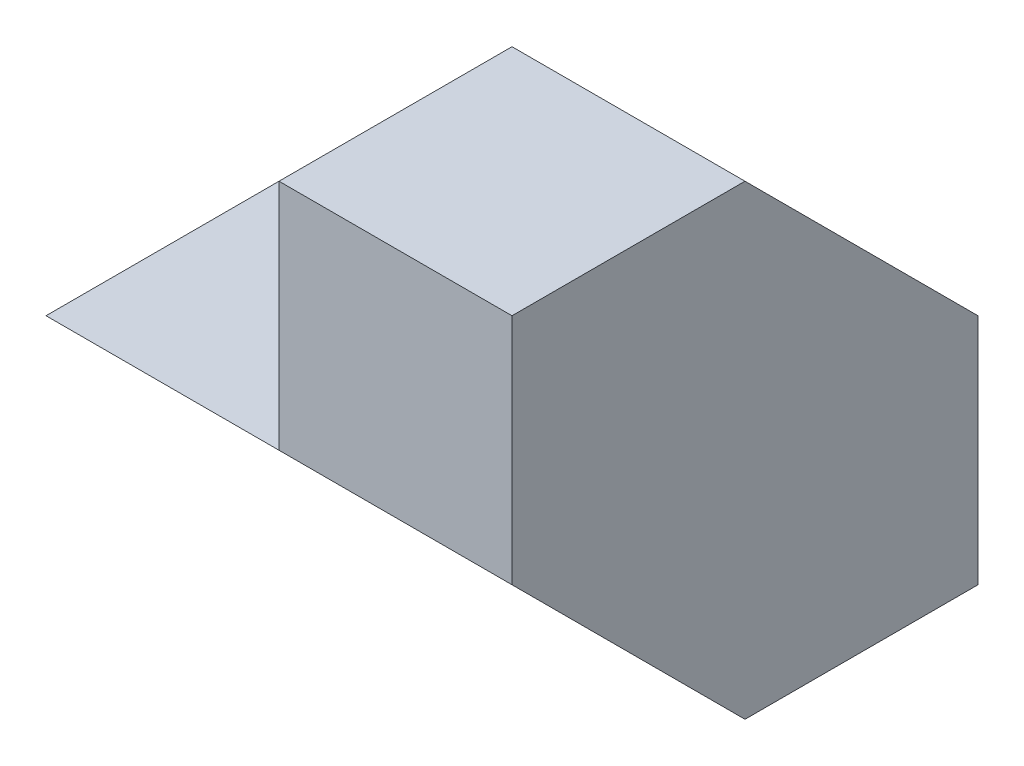
ISO-10303-21;
HEADER;
FILE_DESCRIPTION(('STEP AP214'),'2;1');
FILE_NAME('part.step','',(''),(''),'','','');
FILE_SCHEMA(('AUTOMOTIVE_DESIGN { 1 0 10303 214 1 1 1 1 }'));
ENDSEC;
DATA;
#1=APPLICATION_CONTEXT('core data for automotive mechanical design processes');
#2=APPLICATION_PROTOCOL_DEFINITION('international standard','automotive_design',2000,#1);
#3=PRODUCT_CONTEXT('',#1,'mechanical');
#4=PRODUCT('Part','Part','',(#3));
#5=PRODUCT_RELATED_PRODUCT_CATEGORY('part','',(#4));
#6=PRODUCT_DEFINITION_FORMATION('','',#4);
#7=PRODUCT_DEFINITION_CONTEXT('part definition',#1,'design');
#8=PRODUCT_DEFINITION('design','',#6,#7);
#9=PRODUCT_DEFINITION_SHAPE('','',#8);
#10=(LENGTH_UNIT() NAMED_UNIT(*) SI_UNIT(.MILLI.,.METRE.));
#11=(NAMED_UNIT(*) PLANE_ANGLE_UNIT() SI_UNIT($,.RADIAN.));
#12=(NAMED_UNIT(*) SI_UNIT($,.STERADIAN.) SOLID_ANGLE_UNIT());
#13=UNCERTAINTY_MEASURE_WITH_UNIT(LENGTH_MEASURE(1.E-05),#10,'distance_accuracy_value','');
#14=(GEOMETRIC_REPRESENTATION_CONTEXT(3) GLOBAL_UNCERTAINTY_ASSIGNED_CONTEXT((#13)) GLOBAL_UNIT_ASSIGNED_CONTEXT((#10,
#11,#12)) REPRESENTATION_CONTEXT('',''));
#15=CARTESIAN_POINT('',(0.,0.,0.));
#16=DIRECTION('',(0.,0.,1.));
#17=DIRECTION('',(1.,0.,0.));
#18=AXIS2_PLACEMENT_3D('',#15,#16,#17);
#19=CARTESIAN_POINT('',(0.,0.,40.));
#20=DIRECTION('',(1.,0.,0.));
#21=DIRECTION('',(0.,0.,-1.));
#22=AXIS2_PLACEMENT_3D('',#19,#20,#21);
#23=PLANE('',#22);
#24=DIRECTION('',(0.,0.,-1.));
#25=VECTOR('',#24,1.);
#26=CARTESIAN_POINT('',(0.,0.,40.));
#27=LINE('',#26,#25);
#28=CARTESIAN_POINT('',(0.,0.,20.));
#29=VERTEX_POINT('',#28);
#30=CARTESIAN_POINT('',(0.,0.,0.));
#31=VERTEX_POINT('',#30);
#32=EDGE_CURVE('E11',#29,#31,#27,.T.);
#33=ORIENTED_EDGE('',*,*,#32,.F.);
#34=DIRECTION('',(0.,-0.707106781186548,-0.707106781186548));
#35=VECTOR('',#34,1.);
#36=CARTESIAN_POINT('',(0.,20.,40.));
#37=LINE('',#36,#35);
#38=CARTESIAN_POINT('',(0.,20.,40.));
#39=VERTEX_POINT('',#38);
#40=EDGE_CURVE('E114',#39,#29,#37,.T.);
#41=ORIENTED_EDGE('',*,*,#40,.F.);
#42=DIRECTION('',(0.,0.,-1.));
#43=VECTOR('',#42,1.);
#44=CARTESIAN_POINT('',(0.,20.,40.));
#45=LINE('',#44,#43);
#46=CARTESIAN_POINT('',(0.,20.,0.));
#47=VERTEX_POINT('',#46);
#48=EDGE_CURVE('E160',#39,#47,#45,.T.);
#49=ORIENTED_EDGE('',*,*,#48,.T.);
#50=DIRECTION('',(0.,-1.,0.));
#51=VECTOR('',#50,1.);
#52=CARTESIAN_POINT('',(0.,0.,0.));
#53=LINE('',#52,#51);
#54=EDGE_CURVE('E150',#47,#31,#53,.T.);
#55=ORIENTED_EDGE('',*,*,#54,.T.);
#56=EDGE_LOOP('',(#33,#41,#49,#55));
#57=FACE_BOUND('',#56,.T.);
#58=ADVANCED_FACE('F33',(#57),#23,.F.);
#59=CARTESIAN_POINT('',(0.,0.,40.));
#60=DIRECTION('',(0.,1.,0.));
#61=DIRECTION('',(0.,0.,1.));
#62=AXIS2_PLACEMENT_3D('',#59,#60,#61);
#63=PLANE('',#62);
#64=DIRECTION('',(0.,0.,-1.));
#65=VECTOR('',#64,1.);
#66=CARTESIAN_POINT('',(40.,0.,40.));
#67=LINE('',#66,#65);
#68=CARTESIAN_POINT('',(40.,0.,20.));
#69=VERTEX_POINT('',#68);
#70=CARTESIAN_POINT('',(40.,0.,0.));
#71=VERTEX_POINT('',#70);
#72=EDGE_CURVE('E41',#69,#71,#67,.T.);
#73=ORIENTED_EDGE('',*,*,#72,.F.);
#74=DIRECTION('',(-1.,0.,0.));
#75=VECTOR('',#74,1.);
#76=CARTESIAN_POINT('',(40.,0.,20.));
#77=LINE('',#76,#75);
#78=EDGE_CURVE('E167',#69,#29,#77,.T.);
#79=ORIENTED_EDGE('',*,*,#78,.T.);
#80=ORIENTED_EDGE('',*,*,#32,.T.);
#81=DIRECTION('',(1.,0.,0.));
#82=VECTOR('',#81,1.);
#83=CARTESIAN_POINT('',(0.,0.,0.));
#84=LINE('',#83,#82);
#85=EDGE_CURVE('E153',#31,#71,#84,.T.);
#86=ORIENTED_EDGE('',*,*,#85,.T.);
#87=EDGE_LOOP('',(#73,#79,#80,#86));
#88=FACE_BOUND('',#87,.T.);
#89=ADVANCED_FACE('F165',(#88),#63,.F.);
#90=CARTESIAN_POINT('',(40.,0.,40.));
#91=DIRECTION('',(-1.,0.,0.));
#92=DIRECTION('',(0.,0.,1.));
#93=AXIS2_PLACEMENT_3D('',#90,#91,#92);
#94=PLANE('',#93);
#95=DIRECTION('',(0.,1.,0.));
#96=VECTOR('',#95,1.);
#97=CARTESIAN_POINT('',(40.,0.,0.));
#98=LINE('',#97,#96);
#99=CARTESIAN_POINT('',(40.,20.,0.));
#100=VERTEX_POINT('',#99);
#101=EDGE_CURVE('E144',#71,#100,#98,.T.);
#102=ORIENTED_EDGE('',*,*,#101,.T.);
#103=DIRECTION('',(0.,0.707106781186548,0.707106781186548));
#104=VECTOR('',#103,1.);
#105=CARTESIAN_POINT('',(40.,30.,10.));
#106=LINE('',#105,#104);
#107=CARTESIAN_POINT('',(40.,40.,20.));
#108=VERTEX_POINT('',#107);
#109=EDGE_CURVE('E106',#100,#108,#106,.T.);
#110=ORIENTED_EDGE('',*,*,#109,.T.);
#111=DIRECTION('',(0.,0.,-1.));
#112=VECTOR('',#111,1.);
#113=CARTESIAN_POINT('',(40.,40.,40.));
#114=LINE('',#113,#112);
#115=CARTESIAN_POINT('',(40.,40.,40.));
#116=VERTEX_POINT('',#115);
#117=EDGE_CURVE('E105',#116,#108,#114,.T.);
#118=ORIENTED_EDGE('',*,*,#117,.F.);
#119=DIRECTION('',(0.,-1.,0.));
#120=VECTOR('',#119,1.);
#121=CARTESIAN_POINT('',(40.,20.,40.));
#122=LINE('',#121,#120);
#123=CARTESIAN_POINT('',(40.,20.,40.));
#124=VERTEX_POINT('',#123);
#125=EDGE_CURVE('E130',#116,#124,#122,.T.);
#126=ORIENTED_EDGE('',*,*,#125,.T.);
#127=DIRECTION('',(0.,-0.707106781186548,-0.707106781186548));
#128=VECTOR('',#127,1.);
#129=CARTESIAN_POINT('',(40.,20.,40.));
#130=LINE('',#129,#128);
#131=EDGE_CURVE('E122',#124,#69,#130,.T.);
#132=ORIENTED_EDGE('',*,*,#131,.T.);
#133=ORIENTED_EDGE('',*,*,#72,.T.);
#134=EDGE_LOOP('',(#102,#110,#118,#126,#132,#133));
#135=FACE_BOUND('',#134,.T.);
#136=ADVANCED_FACE('F142',(#135),#94,.F.);
#137=CARTESIAN_POINT('',(0.,20.,40.));
#138=DIRECTION('',(0.,-1.,0.));
#139=DIRECTION('',(0.,0.,-1.));
#140=AXIS2_PLACEMENT_3D('',#137,#138,#139);
#141=PLANE('',#140);
#142=DIRECTION('',(-1.,0.,0.));
#143=VECTOR('',#142,1.);
#144=CARTESIAN_POINT('',(0.,20.,40.));
#145=LINE('',#144,#143);
#146=CARTESIAN_POINT('',(20.,20.,40.));
#147=VERTEX_POINT('',#146);
#148=EDGE_CURVE('E151',#147,#39,#145,.T.);
#149=ORIENTED_EDGE('',*,*,#148,.F.);
#150=DIRECTION('',(0.,0.,-1.));
#151=VECTOR('',#150,1.);
#152=CARTESIAN_POINT('',(20.,20.,40.));
#153=LINE('',#152,#151);
#154=CARTESIAN_POINT('',(20.,20.,0.));
#155=VERTEX_POINT('',#154);
#156=EDGE_CURVE('E112',#147,#155,#153,.T.);
#157=ORIENTED_EDGE('',*,*,#156,.T.);
#158=DIRECTION('',(-1.,0.,0.));
#159=VECTOR('',#158,1.);
#160=CARTESIAN_POINT('',(0.,20.,0.));
#161=LINE('',#160,#159);
#162=EDGE_CURVE('E57',#155,#47,#161,.T.);
#163=ORIENTED_EDGE('',*,*,#162,.T.);
#164=ORIENTED_EDGE('',*,*,#48,.F.);
#165=EDGE_LOOP('',(#149,#157,#163,#164));
#166=FACE_BOUND('',#165,.T.);
#167=ADVANCED_FACE('F178',(#166),#141,.F.);
#168=CARTESIAN_POINT('',(0.,0.,0.));
#169=DIRECTION('',(0.,0.,-1.));
#170=DIRECTION('',(-1.,0.,0.));
#171=AXIS2_PLACEMENT_3D('',#168,#169,#170);
#172=PLANE('',#171);
#173=DIRECTION('',(-1.,0.,0.));
#174=VECTOR('',#173,1.);
#175=CARTESIAN_POINT('',(60.,20.,0.));
#176=LINE('',#175,#174);
#177=EDGE_CURVE('E49',#100,#155,#176,.T.);
#178=ORIENTED_EDGE('',*,*,#177,.F.);
#179=ORIENTED_EDGE('',*,*,#101,.F.);
#180=ORIENTED_EDGE('',*,*,#85,.F.);
#181=ORIENTED_EDGE('',*,*,#54,.F.);
#182=ORIENTED_EDGE('',*,*,#162,.F.);
#183=EDGE_LOOP('',(#178,#179,#180,#181,#182));
#184=FACE_BOUND('',#183,.T.);
#185=ADVANCED_FACE('F146',(#184),#172,.T.);
#186=CARTESIAN_POINT('',(40.,20.,40.));
#187=DIRECTION('',(0.,0.707106781186548,-0.707106781186548));
#188=DIRECTION('',(0.,0.707106781186548,0.707106781186548));
#189=AXIS2_PLACEMENT_3D('',#186,#187,#188);
#190=PLANE('',#189);
#191=ORIENTED_EDGE('',*,*,#40,.T.);
#192=ORIENTED_EDGE('',*,*,#78,.F.);
#193=ORIENTED_EDGE('',*,*,#131,.F.);
#194=EDGE_CURVE('E126',#124,#147,#145,.T.);
#195=ORIENTED_EDGE('',*,*,#194,.T.);
#196=ORIENTED_EDGE('',*,*,#148,.T.);
#197=EDGE_LOOP('',(#191,#192,#193,#195,#196));
#198=FACE_BOUND('',#197,.T.);
#199=ADVANCED_FACE('F174',(#198),#190,.F.);
#200=CARTESIAN_POINT('',(40.,40.,40.));
#201=DIRECTION('',(0.,1.,0.));
#202=DIRECTION('',(0.,0.,1.));
#203=AXIS2_PLACEMENT_3D('',#200,#201,#202);
#204=PLANE('',#203);
#205=DIRECTION('',(-1.,0.,0.));
#206=VECTOR('',#205,1.);
#207=CARTESIAN_POINT('',(60.,40.,20.));
#208=LINE('',#207,#206);
#209=CARTESIAN_POINT('',(20.,40.,20.));
#210=VERTEX_POINT('',#209);
#211=EDGE_CURVE('E94',#108,#210,#208,.T.);
#212=ORIENTED_EDGE('',*,*,#211,.T.);
#213=DIRECTION('',(0.,0.,-1.));
#214=VECTOR('',#213,1.);
#215=CARTESIAN_POINT('',(20.,40.,40.));
#216=LINE('',#215,#214);
#217=CARTESIAN_POINT('',(20.,40.,40.));
#218=VERTEX_POINT('',#217);
#219=EDGE_CURVE('E103',#218,#210,#216,.T.);
#220=ORIENTED_EDGE('',*,*,#219,.F.);
#221=DIRECTION('',(1.,0.,0.));
#222=VECTOR('',#221,1.);
#223=CARTESIAN_POINT('',(40.,40.,40.));
#224=LINE('',#223,#222);
#225=EDGE_CURVE('E116',#218,#116,#224,.T.);
#226=ORIENTED_EDGE('',*,*,#225,.T.);
#227=ORIENTED_EDGE('',*,*,#117,.T.);
#228=EDGE_LOOP('',(#212,#220,#226,#227));
#229=FACE_BOUND('',#228,.T.);
#230=ADVANCED_FACE('F101',(#229),#204,.T.);
#231=CARTESIAN_POINT('',(20.,20.,40.));
#232=DIRECTION('',(-1.,0.,0.));
#233=DIRECTION('',(0.,0.,1.));
#234=AXIS2_PLACEMENT_3D('',#231,#232,#233);
#235=PLANE('',#234);
#236=DIRECTION('',(0.,0.707106781186548,0.707106781186548));
#237=VECTOR('',#236,1.);
#238=CARTESIAN_POINT('',(20.,20.,0.));
#239=LINE('',#238,#237);
#240=EDGE_CURVE('E91',#155,#210,#239,.T.);
#241=ORIENTED_EDGE('',*,*,#240,.F.);
#242=ORIENTED_EDGE('',*,*,#156,.F.);
#243=DIRECTION('',(0.,1.,0.));
#244=VECTOR('',#243,1.);
#245=CARTESIAN_POINT('',(20.,20.,40.));
#246=LINE('',#245,#244);
#247=EDGE_CURVE('E110',#147,#218,#246,.T.);
#248=ORIENTED_EDGE('',*,*,#247,.T.);
#249=ORIENTED_EDGE('',*,*,#219,.T.);
#250=EDGE_LOOP('',(#241,#242,#248,#249));
#251=FACE_BOUND('',#250,.T.);
#252=ADVANCED_FACE('F108',(#251),#235,.T.);
#253=CARTESIAN_POINT('',(0.,0.,40.));
#254=DIRECTION('',(0.,0.,1.));
#255=DIRECTION('',(1.,0.,0.));
#256=AXIS2_PLACEMENT_3D('',#253,#254,#255);
#257=PLANE('',#256);
#258=ORIENTED_EDGE('',*,*,#125,.F.);
#259=ORIENTED_EDGE('',*,*,#225,.F.);
#260=ORIENTED_EDGE('',*,*,#247,.F.);
#261=ORIENTED_EDGE('',*,*,#194,.F.);
#262=EDGE_LOOP('',(#258,#259,#260,#261));
#263=FACE_BOUND('',#262,.T.);
#264=ADVANCED_FACE('F180',(#263),#257,.T.);
#265=CARTESIAN_POINT('',(60.,20.,0.));
#266=DIRECTION('',(0.,-0.707106781186548,0.707106781186548));
#267=DIRECTION('',(0.,-0.707106781186548,-0.707106781186548));
#268=AXIS2_PLACEMENT_3D('',#265,#266,#267);
#269=PLANE('',#268);
#270=ORIENTED_EDGE('',*,*,#177,.T.);
#271=ORIENTED_EDGE('',*,*,#240,.T.);
#272=ORIENTED_EDGE('',*,*,#211,.F.);
#273=ORIENTED_EDGE('',*,*,#109,.F.);
#274=EDGE_LOOP('',(#270,#271,#272,#273));
#275=FACE_BOUND('',#274,.T.);
#276=ADVANCED_FACE('F93',(#275),#269,.F.);
#277=CLOSED_SHELL('',(#58,#89,#136,#167,#185,#199,#230,#252,#264,#276));
#278=MANIFOLD_SOLID_BREP('B2',#277);
#279=ADVANCED_BREP_SHAPE_REPRESENTATION('',(#18,#278),#14);
#280=SHAPE_DEFINITION_REPRESENTATION(#9,#279);
ENDSEC;
END-ISO-10303-21;
